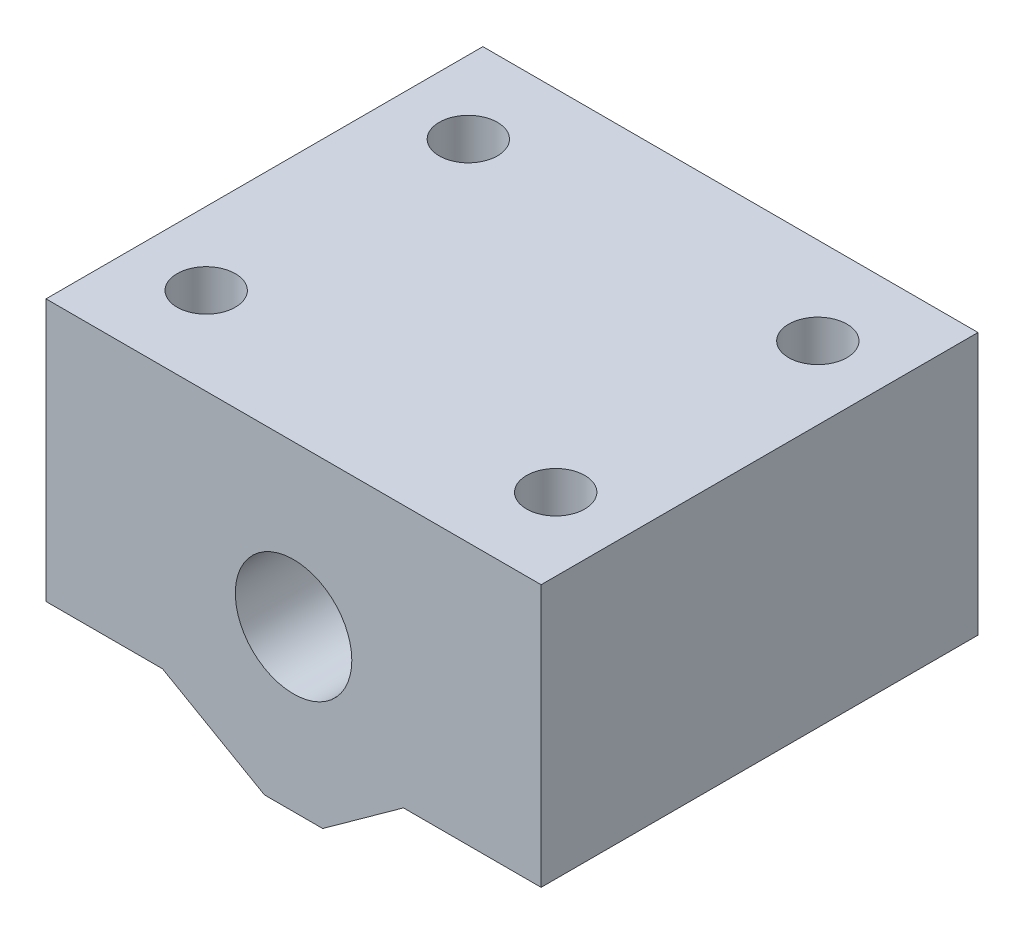
ISO-10303-21;
HEADER;
FILE_DESCRIPTION(('STEP AP214'),'2;1');
FILE_NAME('part.step','',(''),(''),'','','');
FILE_SCHEMA(('AUTOMOTIVE_DESIGN { 1 0 10303 214 1 1 1 1 }'));
ENDSEC;
DATA;
#1=APPLICATION_CONTEXT('core data for automotive mechanical design processes');
#2=APPLICATION_PROTOCOL_DEFINITION('international standard','automotive_design',2000,#1);
#3=PRODUCT_CONTEXT('',#1,'mechanical');
#4=PRODUCT('Part','Part','',(#3));
#5=PRODUCT_RELATED_PRODUCT_CATEGORY('part','',(#4));
#6=PRODUCT_DEFINITION_FORMATION('','',#4);
#7=PRODUCT_DEFINITION_CONTEXT('part definition',#1,'design');
#8=PRODUCT_DEFINITION('design','',#6,#7);
#9=PRODUCT_DEFINITION_SHAPE('','',#8);
#10=(LENGTH_UNIT() NAMED_UNIT(*) SI_UNIT(.MILLI.,.METRE.));
#11=(NAMED_UNIT(*) PLANE_ANGLE_UNIT() SI_UNIT($,.RADIAN.));
#12=(NAMED_UNIT(*) SI_UNIT($,.STERADIAN.) SOLID_ANGLE_UNIT());
#13=UNCERTAINTY_MEASURE_WITH_UNIT(LENGTH_MEASURE(1.E-05),#10,'distance_accuracy_value','');
#14=(GEOMETRIC_REPRESENTATION_CONTEXT(3) GLOBAL_UNCERTAINTY_ASSIGNED_CONTEXT((#13)) GLOBAL_UNIT_ASSIGNED_CONTEXT((#10,
#11,#12)) REPRESENTATION_CONTEXT('',''));
#15=CARTESIAN_POINT('',(0.,0.,0.));
#16=DIRECTION('',(0.,0.,1.));
#17=DIRECTION('',(1.,0.,0.));
#18=AXIS2_PLACEMENT_3D('',#15,#16,#17);
#19=CARTESIAN_POINT('',(0.,0.,30.));
#20=DIRECTION('',(0.,0.,-1.));
#21=DIRECTION('',(-1.,0.,0.));
#22=AXIS2_PLACEMENT_3D('',#19,#20,#21);
#23=PLANE('',#22);
#24=DIRECTION('',(0.,-1.,0.));
#25=VECTOR('',#24,1.);
#26=CARTESIAN_POINT('',(0.,-18.,30.));
#27=LINE('',#26,#25);
#28=CARTESIAN_POINT('',(0.,0.,30.));
#29=VERTEX_POINT('',#28);
#30=CARTESIAN_POINT('',(0.,-18.,30.));
#31=VERTEX_POINT('',#30);
#32=EDGE_CURVE('E146',#29,#31,#27,.T.);
#33=ORIENTED_EDGE('',*,*,#32,.T.);
#34=DIRECTION('',(1.,0.,0.));
#35=VECTOR('',#34,1.);
#36=CARTESIAN_POINT('',(0.,-18.,30.));
#37=LINE('',#36,#35);
#38=CARTESIAN_POINT('',(8.,-18.,30.));
#39=VERTEX_POINT('',#38);
#40=EDGE_CURVE('E93',#31,#39,#37,.T.);
#41=ORIENTED_EDGE('',*,*,#40,.T.);
#42=DIRECTION('',(0.868243142124459,-0.496138938356834,0.));
#43=VECTOR('',#42,1.);
#44=CARTESIAN_POINT('',(8.,-18.,30.));
#45=LINE('',#44,#43);
#46=CARTESIAN_POINT('',(15.,-22.,30.));
#47=VERTEX_POINT('',#46);
#48=EDGE_CURVE('E161',#39,#47,#45,.T.);
#49=ORIENTED_EDGE('',*,*,#48,.T.);
#50=DIRECTION('',(1.,0.,0.));
#51=VECTOR('',#50,1.);
#52=CARTESIAN_POINT('',(17.,-22.,30.));
#53=LINE('',#52,#51);
#54=CARTESIAN_POINT('',(19.,-22.,30.));
#55=VERTEX_POINT('',#54);
#56=EDGE_CURVE('E173',#47,#55,#53,.T.);
#57=ORIENTED_EDGE('',*,*,#56,.T.);
#58=DIRECTION('',(0.811157776707215,0.584827377340877,0.));
#59=VECTOR('',#58,1.);
#60=CARTESIAN_POINT('',(24.5480150768278,-18.,30.));
#61=LINE('',#60,#59);
#62=CARTESIAN_POINT('',(24.5480150768278,-18.,30.));
#63=VERTEX_POINT('',#62);
#64=EDGE_CURVE('E112',#55,#63,#61,.T.);
#65=ORIENTED_EDGE('',*,*,#64,.T.);
#66=DIRECTION('',(1.,0.,0.));
#67=VECTOR('',#66,1.);
#68=CARTESIAN_POINT('',(27.5480150768278,-18.,30.));
#69=LINE('',#68,#67);
#70=CARTESIAN_POINT('',(34.,-18.,30.));
#71=VERTEX_POINT('',#70);
#72=EDGE_CURVE('E106',#63,#71,#69,.T.);
#73=ORIENTED_EDGE('',*,*,#72,.T.);
#74=DIRECTION('',(0.,1.,0.));
#75=VECTOR('',#74,1.);
#76=CARTESIAN_POINT('',(34.,0.,30.));
#77=LINE('',#76,#75);
#78=CARTESIAN_POINT('',(34.,0.,30.));
#79=VERTEX_POINT('',#78);
#80=EDGE_CURVE('E110',#71,#79,#77,.T.);
#81=ORIENTED_EDGE('',*,*,#80,.T.);
#82=DIRECTION('',(-1.,0.,0.));
#83=VECTOR('',#82,1.);
#84=CARTESIAN_POINT('',(0.,0.,30.));
#85=LINE('',#84,#83);
#86=EDGE_CURVE('E50',#79,#29,#85,.T.);
#87=ORIENTED_EDGE('',*,*,#86,.T.);
#88=EDGE_LOOP('',(#33,#41,#49,#57,#65,#73,#81,#87));
#89=FACE_BOUND('',#88,.T.);
#90=CARTESIAN_POINT('',(17.,-11.,30.));
#91=DIRECTION('',(0.,0.,1.));
#92=DIRECTION('',(1.,0.,0.));
#93=AXIS2_PLACEMENT_3D('',#90,#91,#92);
#94=CIRCLE('',#93,4.);
#95=CARTESIAN_POINT('',(21.,-11.,30.));
#96=VERTEX_POINT('',#95);
#97=EDGE_CURVE('E133',#96,#96,#94,.T.);
#98=ORIENTED_EDGE('',*,*,#97,.F.);
#99=EDGE_LOOP('',(#98));
#100=FACE_BOUND('',#99,.T.);
#101=ADVANCED_FACE('F33',(#89,#100),#23,.F.);
#102=CARTESIAN_POINT('',(0.,0.,0.));
#103=DIRECTION('',(0.,0.,-1.));
#104=DIRECTION('',(-1.,0.,0.));
#105=AXIS2_PLACEMENT_3D('',#102,#103,#104);
#106=PLANE('',#105);
#107=DIRECTION('',(0.,-1.,0.));
#108=VECTOR('',#107,1.);
#109=CARTESIAN_POINT('',(0.,-18.,0.));
#110=LINE('',#109,#108);
#111=CARTESIAN_POINT('',(0.,0.,0.));
#112=VERTEX_POINT('',#111);
#113=CARTESIAN_POINT('',(0.,-18.,0.));
#114=VERTEX_POINT('',#113);
#115=EDGE_CURVE('E129',#112,#114,#110,.T.);
#116=ORIENTED_EDGE('',*,*,#115,.F.);
#117=DIRECTION('',(-1.,0.,0.));
#118=VECTOR('',#117,1.);
#119=CARTESIAN_POINT('',(0.,0.,0.));
#120=LINE('',#119,#118);
#121=CARTESIAN_POINT('',(34.,0.,0.));
#122=VERTEX_POINT('',#121);
#123=EDGE_CURVE('E85',#122,#112,#120,.T.);
#124=ORIENTED_EDGE('',*,*,#123,.F.);
#125=DIRECTION('',(0.,1.,0.));
#126=VECTOR('',#125,1.);
#127=CARTESIAN_POINT('',(34.,0.,0.));
#128=LINE('',#127,#126);
#129=CARTESIAN_POINT('',(34.,-18.,0.));
#130=VERTEX_POINT('',#129);
#131=EDGE_CURVE('E79',#130,#122,#128,.T.);
#132=ORIENTED_EDGE('',*,*,#131,.F.);
#133=DIRECTION('',(1.,0.,0.));
#134=VECTOR('',#133,1.);
#135=CARTESIAN_POINT('',(34.,-18.,0.));
#136=LINE('',#135,#134);
#137=CARTESIAN_POINT('',(24.5480150768278,-18.,0.));
#138=VERTEX_POINT('',#137);
#139=EDGE_CURVE('E119',#138,#130,#136,.T.);
#140=ORIENTED_EDGE('',*,*,#139,.F.);
#141=DIRECTION('',(0.811157776707215,0.584827377340877,0.));
#142=VECTOR('',#141,1.);
#143=CARTESIAN_POINT('',(24.5480150768278,-18.,0.));
#144=LINE('',#143,#142);
#145=CARTESIAN_POINT('',(19.,-22.,0.));
#146=VERTEX_POINT('',#145);
#147=EDGE_CURVE('E140',#146,#138,#144,.T.);
#148=ORIENTED_EDGE('',*,*,#147,.F.);
#149=DIRECTION('',(1.,0.,0.));
#150=VECTOR('',#149,1.);
#151=CARTESIAN_POINT('',(17.,-22.,0.));
#152=LINE('',#151,#150);
#153=CARTESIAN_POINT('',(15.,-22.,0.));
#154=VERTEX_POINT('',#153);
#155=EDGE_CURVE('E138',#154,#146,#152,.T.);
#156=ORIENTED_EDGE('',*,*,#155,.F.);
#157=DIRECTION('',(0.868243142124459,-0.496138938356834,0.));
#158=VECTOR('',#157,1.);
#159=CARTESIAN_POINT('',(8.,-18.,0.));
#160=LINE('',#159,#158);
#161=CARTESIAN_POINT('',(8.,-18.,0.));
#162=VERTEX_POINT('',#161);
#163=EDGE_CURVE('E135',#162,#154,#160,.T.);
#164=ORIENTED_EDGE('',*,*,#163,.F.);
#165=DIRECTION('',(1.,0.,0.));
#166=VECTOR('',#165,1.);
#167=CARTESIAN_POINT('',(5.,-18.,0.));
#168=LINE('',#167,#166);
#169=EDGE_CURVE('E132',#114,#162,#168,.T.);
#170=ORIENTED_EDGE('',*,*,#169,.F.);
#171=EDGE_LOOP('',(#116,#124,#132,#140,#148,#156,#164,#170));
#172=FACE_BOUND('',#171,.T.);
#173=CARTESIAN_POINT('',(17.,-11.,0.));
#174=DIRECTION('',(0.,0.,1.));
#175=DIRECTION('',(1.,0.,0.));
#176=AXIS2_PLACEMENT_3D('',#173,#174,#175);
#177=CIRCLE('',#176,4.);
#178=CARTESIAN_POINT('',(21.,-11.,0.));
#179=VERTEX_POINT('',#178);
#180=EDGE_CURVE('E179',#179,#179,#177,.T.);
#181=ORIENTED_EDGE('',*,*,#180,.T.);
#182=EDGE_LOOP('',(#181));
#183=FACE_BOUND('',#182,.T.);
#184=ADVANCED_FACE('F164',(#172,#183),#106,.T.);
#185=CARTESIAN_POINT('',(0.,-18.,30.));
#186=DIRECTION('',(1.,0.,0.));
#187=DIRECTION('',(0.,0.,-1.));
#188=AXIS2_PLACEMENT_3D('',#185,#186,#187);
#189=PLANE('',#188);
#190=ORIENTED_EDGE('',*,*,#115,.T.);
#191=DIRECTION('',(0.,0.,-1.));
#192=VECTOR('',#191,1.);
#193=CARTESIAN_POINT('',(0.,-18.,30.));
#194=LINE('',#193,#192);
#195=EDGE_CURVE('E11',#31,#114,#194,.T.);
#196=ORIENTED_EDGE('',*,*,#195,.F.);
#197=ORIENTED_EDGE('',*,*,#32,.F.);
#198=DIRECTION('',(0.,0.,-1.));
#199=VECTOR('',#198,1.);
#200=CARTESIAN_POINT('',(0.,0.,30.));
#201=LINE('',#200,#199);
#202=EDGE_CURVE('E125',#29,#112,#201,.T.);
#203=ORIENTED_EDGE('',*,*,#202,.T.);
#204=EDGE_LOOP('',(#190,#196,#197,#203));
#205=FACE_BOUND('',#204,.T.);
#206=ADVANCED_FACE('F35',(#205),#189,.F.);
#207=CARTESIAN_POINT('',(5.,-18.,30.));
#208=DIRECTION('',(0.,1.,0.));
#209=DIRECTION('',(0.,0.,1.));
#210=AXIS2_PLACEMENT_3D('',#207,#208,#209);
#211=PLANE('',#210);
#212=CARTESIAN_POINT('',(5.,-18.,24.));
#213=DIRECTION('',(0.,-1.,0.));
#214=DIRECTION('',(0.,0.,-1.));
#215=AXIS2_PLACEMENT_3D('',#212,#213,#214);
#216=CIRCLE('',#215,2.);
#217=CARTESIAN_POINT('',(5.,-18.,22.));
#218=VERTEX_POINT('',#217);
#219=EDGE_CURVE('E191',#218,#218,#216,.T.);
#220=ORIENTED_EDGE('',*,*,#219,.F.);
#221=EDGE_LOOP('',(#220));
#222=FACE_BOUND('',#221,.T.);
#223=CARTESIAN_POINT('',(5.,-18.,6.));
#224=DIRECTION('',(0.,-1.,0.));
#225=DIRECTION('',(0.,0.,-1.));
#226=AXIS2_PLACEMENT_3D('',#223,#224,#225);
#227=CIRCLE('',#226,2.);
#228=CARTESIAN_POINT('',(5.,-18.,4.));
#229=VERTEX_POINT('',#228);
#230=EDGE_CURVE('E185',#229,#229,#227,.T.);
#231=ORIENTED_EDGE('',*,*,#230,.F.);
#232=EDGE_LOOP('',(#231));
#233=FACE_BOUND('',#232,.T.);
#234=ORIENTED_EDGE('',*,*,#169,.T.);
#235=DIRECTION('',(0.,0.,-1.));
#236=VECTOR('',#235,1.);
#237=CARTESIAN_POINT('',(8.,-18.,30.));
#238=LINE('',#237,#236);
#239=EDGE_CURVE('E42',#39,#162,#238,.T.);
#240=ORIENTED_EDGE('',*,*,#239,.F.);
#241=ORIENTED_EDGE('',*,*,#40,.F.);
#242=ORIENTED_EDGE('',*,*,#195,.T.);
#243=EDGE_LOOP('',(#234,#240,#241,#242));
#244=FACE_BOUND('',#243,.T.);
#245=ADVANCED_FACE('F256',(#222,#233,#244),#211,.F.);
#246=CARTESIAN_POINT('',(8.,-18.,30.));
#247=DIRECTION('',(0.496138938356834,0.868243142124459,0.));
#248=DIRECTION('',(-0.868243142124459,0.496138938356834,0.));
#249=AXIS2_PLACEMENT_3D('',#246,#247,#248);
#250=PLANE('',#249);
#251=ORIENTED_EDGE('',*,*,#163,.T.);
#252=DIRECTION('',(0.,0.,-1.));
#253=VECTOR('',#252,1.);
#254=CARTESIAN_POINT('',(15.,-22.,30.));
#255=LINE('',#254,#253);
#256=EDGE_CURVE('E153',#47,#154,#255,.T.);
#257=ORIENTED_EDGE('',*,*,#256,.F.);
#258=ORIENTED_EDGE('',*,*,#48,.F.);
#259=ORIENTED_EDGE('',*,*,#239,.T.);
#260=EDGE_LOOP('',(#251,#257,#258,#259));
#261=FACE_BOUND('',#260,.T.);
#262=ADVANCED_FACE('F159',(#261),#250,.F.);
#263=CARTESIAN_POINT('',(17.,-22.,30.));
#264=DIRECTION('',(0.,1.,0.));
#265=DIRECTION('',(0.,0.,1.));
#266=AXIS2_PLACEMENT_3D('',#263,#264,#265);
#267=PLANE('',#266);
#268=ORIENTED_EDGE('',*,*,#155,.T.);
#269=DIRECTION('',(0.,0.,-1.));
#270=VECTOR('',#269,1.);
#271=CARTESIAN_POINT('',(19.,-22.,30.));
#272=LINE('',#271,#270);
#273=EDGE_CURVE('E150',#55,#146,#272,.T.);
#274=ORIENTED_EDGE('',*,*,#273,.F.);
#275=ORIENTED_EDGE('',*,*,#56,.F.);
#276=ORIENTED_EDGE('',*,*,#256,.T.);
#277=EDGE_LOOP('',(#268,#274,#275,#276));
#278=FACE_BOUND('',#277,.T.);
#279=ADVANCED_FACE('F169',(#278),#267,.F.);
#280=CARTESIAN_POINT('',(24.5480150768278,-18.,30.));
#281=DIRECTION('',(-0.584827377340877,0.811157776707215,0.));
#282=DIRECTION('',(-0.811157776707215,-0.584827377340877,0.));
#283=AXIS2_PLACEMENT_3D('',#280,#281,#282);
#284=PLANE('',#283);
#285=ORIENTED_EDGE('',*,*,#147,.T.);
#286=DIRECTION('',(0.,0.,-1.));
#287=VECTOR('',#286,1.);
#288=CARTESIAN_POINT('',(24.5480150768278,-18.,30.));
#289=LINE('',#288,#287);
#290=EDGE_CURVE('E120',#63,#138,#289,.T.);
#291=ORIENTED_EDGE('',*,*,#290,.F.);
#292=ORIENTED_EDGE('',*,*,#64,.F.);
#293=ORIENTED_EDGE('',*,*,#273,.T.);
#294=EDGE_LOOP('',(#285,#291,#292,#293));
#295=FACE_BOUND('',#294,.T.);
#296=ADVANCED_FACE('F172',(#295),#284,.F.);
#297=CARTESIAN_POINT('',(34.,-18.,30.));
#298=DIRECTION('',(0.,1.,0.));
#299=DIRECTION('',(0.,0.,1.));
#300=AXIS2_PLACEMENT_3D('',#297,#298,#299);
#301=PLANE('',#300);
#302=CARTESIAN_POINT('',(29.,-18.,6.));
#303=DIRECTION('',(0.,-1.,0.));
#304=DIRECTION('',(0.,0.,-1.));
#305=AXIS2_PLACEMENT_3D('',#302,#303,#304);
#306=CIRCLE('',#305,2.);
#307=CARTESIAN_POINT('',(29.,-18.,4.));
#308=VERTEX_POINT('',#307);
#309=EDGE_CURVE('E198',#308,#308,#306,.T.);
#310=ORIENTED_EDGE('',*,*,#309,.F.);
#311=EDGE_LOOP('',(#310));
#312=FACE_BOUND('',#311,.T.);
#313=CARTESIAN_POINT('',(29.,-18.,24.));
#314=DIRECTION('',(0.,-1.,0.));
#315=DIRECTION('',(0.,0.,-1.));
#316=AXIS2_PLACEMENT_3D('',#313,#314,#315);
#317=CIRCLE('',#316,2.);
#318=CARTESIAN_POINT('',(29.,-18.,22.));
#319=VERTEX_POINT('',#318);
#320=EDGE_CURVE('E203',#319,#319,#317,.T.);
#321=ORIENTED_EDGE('',*,*,#320,.F.);
#322=EDGE_LOOP('',(#321));
#323=FACE_BOUND('',#322,.T.);
#324=ORIENTED_EDGE('',*,*,#139,.T.);
#325=DIRECTION('',(0.,0.,-1.));
#326=VECTOR('',#325,1.);
#327=CARTESIAN_POINT('',(34.,-18.,30.));
#328=LINE('',#327,#326);
#329=EDGE_CURVE('E117',#71,#130,#328,.T.);
#330=ORIENTED_EDGE('',*,*,#329,.F.);
#331=ORIENTED_EDGE('',*,*,#72,.F.);
#332=ORIENTED_EDGE('',*,*,#290,.T.);
#333=EDGE_LOOP('',(#324,#330,#331,#332));
#334=FACE_BOUND('',#333,.T.);
#335=ADVANCED_FACE('F118',(#312,#323,#334),#301,.F.);
#336=CARTESIAN_POINT('',(34.,0.,30.));
#337=DIRECTION('',(-1.,0.,0.));
#338=DIRECTION('',(0.,0.,1.));
#339=AXIS2_PLACEMENT_3D('',#336,#337,#338);
#340=PLANE('',#339);
#341=ORIENTED_EDGE('',*,*,#131,.T.);
#342=DIRECTION('',(0.,0.,-1.));
#343=VECTOR('',#342,1.);
#344=CARTESIAN_POINT('',(34.,0.,30.));
#345=LINE('',#344,#343);
#346=EDGE_CURVE('E121',#79,#122,#345,.T.);
#347=ORIENTED_EDGE('',*,*,#346,.F.);
#348=ORIENTED_EDGE('',*,*,#80,.F.);
#349=ORIENTED_EDGE('',*,*,#329,.T.);
#350=EDGE_LOOP('',(#341,#347,#348,#349));
#351=FACE_BOUND('',#350,.T.);
#352=ADVANCED_FACE('F123',(#351),#340,.F.);
#353=CARTESIAN_POINT('',(0.,0.,30.));
#354=DIRECTION('',(0.,-1.,0.));
#355=DIRECTION('',(0.,0.,-1.));
#356=AXIS2_PLACEMENT_3D('',#353,#354,#355);
#357=PLANE('',#356);
#358=CARTESIAN_POINT('',(29.,0.,6.));
#359=DIRECTION('',(0.,-1.,0.));
#360=DIRECTION('',(0.,0.,-1.));
#361=AXIS2_PLACEMENT_3D('',#358,#359,#360);
#362=CIRCLE('',#361,2.);
#363=CARTESIAN_POINT('',(29.,0.,4.));
#364=VERTEX_POINT('',#363);
#365=EDGE_CURVE('E188',#364,#364,#362,.T.);
#366=ORIENTED_EDGE('',*,*,#365,.T.);
#367=EDGE_LOOP('',(#366));
#368=FACE_BOUND('',#367,.T.);
#369=CARTESIAN_POINT('',(5.,0.,24.));
#370=DIRECTION('',(0.,-1.,0.));
#371=DIRECTION('',(0.,0.,-1.));
#372=AXIS2_PLACEMENT_3D('',#369,#370,#371);
#373=CIRCLE('',#372,2.);
#374=CARTESIAN_POINT('',(5.,0.,22.));
#375=VERTEX_POINT('',#374);
#376=EDGE_CURVE('E194',#375,#375,#373,.T.);
#377=ORIENTED_EDGE('',*,*,#376,.T.);
#378=EDGE_LOOP('',(#377));
#379=FACE_BOUND('',#378,.T.);
#380=CARTESIAN_POINT('',(29.,0.,24.));
#381=DIRECTION('',(0.,-1.,0.));
#382=DIRECTION('',(0.,0.,-1.));
#383=AXIS2_PLACEMENT_3D('',#380,#381,#382);
#384=CIRCLE('',#383,2.);
#385=CARTESIAN_POINT('',(29.,0.,22.));
#386=VERTEX_POINT('',#385);
#387=EDGE_CURVE('E195',#386,#386,#384,.T.);
#388=ORIENTED_EDGE('',*,*,#387,.T.);
#389=EDGE_LOOP('',(#388));
#390=FACE_BOUND('',#389,.T.);
#391=CARTESIAN_POINT('',(5.,0.,6.));
#392=DIRECTION('',(0.,-1.,0.));
#393=DIRECTION('',(0.,0.,-1.));
#394=AXIS2_PLACEMENT_3D('',#391,#392,#393);
#395=CIRCLE('',#394,2.);
#396=CARTESIAN_POINT('',(5.,0.,4.));
#397=VERTEX_POINT('',#396);
#398=EDGE_CURVE('E182',#397,#397,#395,.T.);
#399=ORIENTED_EDGE('',*,*,#398,.T.);
#400=EDGE_LOOP('',(#399));
#401=FACE_BOUND('',#400,.T.);
#402=ORIENTED_EDGE('',*,*,#123,.T.);
#403=ORIENTED_EDGE('',*,*,#202,.F.);
#404=ORIENTED_EDGE('',*,*,#86,.F.);
#405=ORIENTED_EDGE('',*,*,#346,.T.);
#406=EDGE_LOOP('',(#402,#403,#404,#405));
#407=FACE_BOUND('',#406,.T.);
#408=ADVANCED_FACE('F209',(#368,#379,#390,#401,#407),#357,.F.);
#409=CARTESIAN_POINT('',(17.,-11.,30.));
#410=DIRECTION('',(0.,0.,-1.));
#411=DIRECTION('',(-1.,0.,0.));
#412=AXIS2_PLACEMENT_3D('',#409,#410,#411);
#413=CYLINDRICAL_SURFACE('',#412,4.);
#414=ORIENTED_EDGE('',*,*,#97,.T.);
#415=EDGE_LOOP('',(#414));
#416=FACE_BOUND('',#415,.T.);
#417=ORIENTED_EDGE('',*,*,#180,.F.);
#418=EDGE_LOOP('',(#417));
#419=FACE_BOUND('',#418,.T.);
#420=ADVANCED_FACE('F237',(#416,#419),#413,.F.);
#421=CARTESIAN_POINT('',(5.,0.,6.));
#422=DIRECTION('',(0.,-1.,0.));
#423=DIRECTION('',(0.,0.,-1.));
#424=AXIS2_PLACEMENT_3D('',#421,#422,#423);
#425=CYLINDRICAL_SURFACE('',#424,2.);
#426=ORIENTED_EDGE('',*,*,#398,.F.);
#427=EDGE_LOOP('',(#426));
#428=FACE_BOUND('',#427,.T.);
#429=ORIENTED_EDGE('',*,*,#230,.T.);
#430=EDGE_LOOP('',(#429));
#431=FACE_BOUND('',#430,.T.);
#432=ADVANCED_FACE('F216',(#428,#431),#425,.F.);
#433=CARTESIAN_POINT('',(29.,0.,24.));
#434=DIRECTION('',(0.,-1.,0.));
#435=DIRECTION('',(0.,0.,-1.));
#436=AXIS2_PLACEMENT_3D('',#433,#434,#435);
#437=CYLINDRICAL_SURFACE('',#436,2.);
#438=ORIENTED_EDGE('',*,*,#387,.F.);
#439=EDGE_LOOP('',(#438));
#440=FACE_BOUND('',#439,.T.);
#441=ORIENTED_EDGE('',*,*,#320,.T.);
#442=EDGE_LOOP('',(#441));
#443=FACE_BOUND('',#442,.T.);
#444=ADVANCED_FACE('F212',(#440,#443),#437,.F.);
#445=CARTESIAN_POINT('',(5.,0.,24.));
#446=DIRECTION('',(0.,-1.,0.));
#447=DIRECTION('',(0.,0.,-1.));
#448=AXIS2_PLACEMENT_3D('',#445,#446,#447);
#449=CYLINDRICAL_SURFACE('',#448,2.);
#450=ORIENTED_EDGE('',*,*,#376,.F.);
#451=EDGE_LOOP('',(#450));
#452=FACE_BOUND('',#451,.T.);
#453=ORIENTED_EDGE('',*,*,#219,.T.);
#454=EDGE_LOOP('',(#453));
#455=FACE_BOUND('',#454,.T.);
#456=ADVANCED_FACE('F215',(#452,#455),#449,.F.);
#457=CARTESIAN_POINT('',(29.,0.,6.));
#458=DIRECTION('',(0.,-1.,0.));
#459=DIRECTION('',(0.,0.,-1.));
#460=AXIS2_PLACEMENT_3D('',#457,#458,#459);
#461=CYLINDRICAL_SURFACE('',#460,2.);
#462=ORIENTED_EDGE('',*,*,#365,.F.);
#463=EDGE_LOOP('',(#462));
#464=FACE_BOUND('',#463,.T.);
#465=ORIENTED_EDGE('',*,*,#309,.T.);
#466=EDGE_LOOP('',(#465));
#467=FACE_BOUND('',#466,.T.);
#468=ADVANCED_FACE('F252',(#464,#467),#461,.F.);
#469=CLOSED_SHELL('',(#101,#184,#206,#245,#262,#279,#296,#335,#352,#408,#420,#432,#444,#456,#468));
#470=MANIFOLD_SOLID_BREP('B2',#469);
#471=ADVANCED_BREP_SHAPE_REPRESENTATION('',(#18,#470),#14);
#472=SHAPE_DEFINITION_REPRESENTATION(#9,#471);
ENDSEC;
END-ISO-10303-21;
